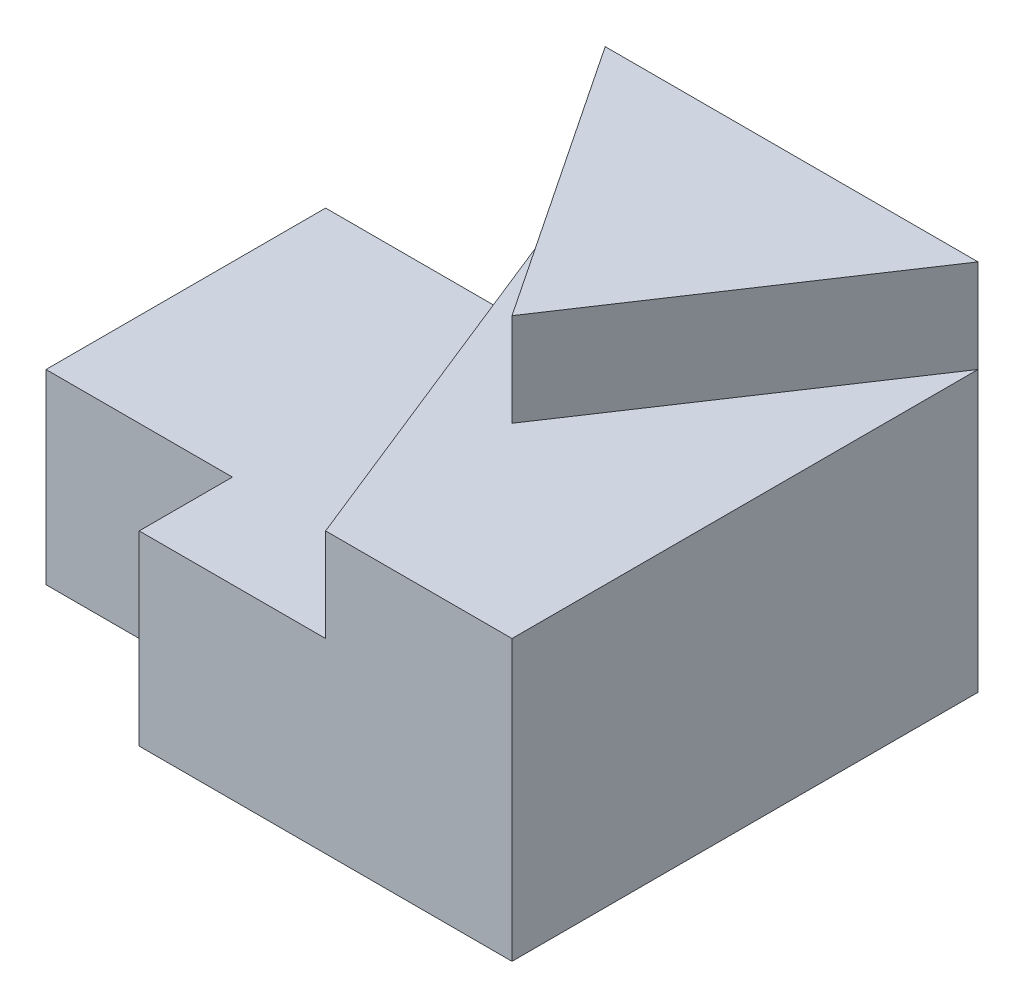
ISO-10303-21;
HEADER;
FILE_DESCRIPTION(('STEP AP214'),'2;1');
FILE_NAME('part.step','',(''),(''),'','','');
FILE_SCHEMA(('AUTOMOTIVE_DESIGN { 1 0 10303 214 1 1 1 1 }'));
ENDSEC;
DATA;
#1=APPLICATION_CONTEXT('core data for automotive mechanical design processes');
#2=APPLICATION_PROTOCOL_DEFINITION('international standard','automotive_design',2000,#1);
#3=PRODUCT_CONTEXT('',#1,'mechanical');
#4=PRODUCT('Part','Part','',(#3));
#5=PRODUCT_RELATED_PRODUCT_CATEGORY('part','',(#4));
#6=PRODUCT_DEFINITION_FORMATION('','',#4);
#7=PRODUCT_DEFINITION_CONTEXT('part definition',#1,'design');
#8=PRODUCT_DEFINITION('design','',#6,#7);
#9=PRODUCT_DEFINITION_SHAPE('','',#8);
#10=(LENGTH_UNIT() NAMED_UNIT(*) SI_UNIT(.MILLI.,.METRE.));
#11=(NAMED_UNIT(*) PLANE_ANGLE_UNIT() SI_UNIT($,.RADIAN.));
#12=(NAMED_UNIT(*) SI_UNIT($,.STERADIAN.) SOLID_ANGLE_UNIT());
#13=UNCERTAINTY_MEASURE_WITH_UNIT(LENGTH_MEASURE(1.E-05),#10,'distance_accuracy_value','');
#14=(GEOMETRIC_REPRESENTATION_CONTEXT(3) GLOBAL_UNCERTAINTY_ASSIGNED_CONTEXT((#13)) GLOBAL_UNIT_ASSIGNED_CONTEXT((#10,
#11,#12)) REPRESENTATION_CONTEXT('',''));
#15=CARTESIAN_POINT('',(0.,0.,0.));
#16=DIRECTION('',(0.,0.,1.));
#17=DIRECTION('',(1.,0.,0.));
#18=AXIS2_PLACEMENT_3D('',#15,#16,#17);
#19=CARTESIAN_POINT('',(0.,9.99999999999999,25.));
#20=DIRECTION('',(1.,0.,0.));
#21=DIRECTION('',(0.,1.,0.));
#22=AXIS2_PLACEMENT_3D('',#19,#20,#21);
#23=PLANE('',#22);
#24=DIRECTION('',(0.,0.,1.));
#25=VECTOR('',#24,1.);
#26=CARTESIAN_POINT('',(0.,9.99999999999998,0.));
#27=LINE('',#26,#25);
#28=CARTESIAN_POINT('',(0.,9.99999999999998,0.));
#29=VERTEX_POINT('',#28);
#30=CARTESIAN_POINT('',(0.,9.99999999999998,5.));
#31=VERTEX_POINT('',#30);
#32=EDGE_CURVE('E129',#29,#31,#27,.T.);
#33=ORIENTED_EDGE('',*,*,#32,.F.);
#34=DIRECTION('',(0.,-1.,0.));
#35=VECTOR('',#34,1.);
#36=CARTESIAN_POINT('',(0.,9.99999999999999,0.));
#37=LINE('',#36,#35);
#38=CARTESIAN_POINT('',(0.,0.,0.));
#39=VERTEX_POINT('',#38);
#40=EDGE_CURVE('E161',#29,#39,#37,.T.);
#41=ORIENTED_EDGE('',*,*,#40,.T.);
#42=DIRECTION('',(0.,0.,-1.));
#43=VECTOR('',#42,1.);
#44=CARTESIAN_POINT('',(0.,0.,25.));
#45=LINE('',#44,#43);
#46=CARTESIAN_POINT('',(0.,0.,5.));
#47=VERTEX_POINT('',#46);
#48=EDGE_CURVE('E40',#47,#39,#45,.T.);
#49=ORIENTED_EDGE('',*,*,#48,.F.);
#50=DIRECTION('',(0.,-1.,0.));
#51=VECTOR('',#50,1.);
#52=CARTESIAN_POINT('',(0.,0.,5.));
#53=LINE('',#52,#51);
#54=EDGE_CURVE('E207',#31,#47,#53,.T.);
#55=ORIENTED_EDGE('',*,*,#54,.F.);
#56=EDGE_LOOP('',(#33,#41,#49,#55));
#57=FACE_BOUND('',#56,.T.);
#58=ADVANCED_FACE('F33',(#57),#23,.F.);
#59=CARTESIAN_POINT('',(0.,9.99999999999998,20.));
#60=VERTEX_POINT('',#59);
#61=CARTESIAN_POINT('',(0.,9.99999999999998,25.));
#62=VERTEX_POINT('',#61);
#63=EDGE_CURVE('E118',#60,#62,#27,.T.);
#64=ORIENTED_EDGE('',*,*,#63,.F.);
#65=DIRECTION('',(0.,1.,0.));
#66=VECTOR('',#65,1.);
#67=CARTESIAN_POINT('',(0.,0.,20.));
#68=LINE('',#67,#66);
#69=CARTESIAN_POINT('',(0.,0.,20.));
#70=VERTEX_POINT('',#69);
#71=EDGE_CURVE('E197',#70,#60,#68,.T.);
#72=ORIENTED_EDGE('',*,*,#71,.F.);
#73=CARTESIAN_POINT('',(0.,0.,25.));
#74=VERTEX_POINT('',#73);
#75=EDGE_CURVE('E11',#74,#70,#45,.T.);
#76=ORIENTED_EDGE('',*,*,#75,.F.);
#77=DIRECTION('',(0.,-1.,0.));
#78=VECTOR('',#77,1.);
#79=CARTESIAN_POINT('',(0.,9.99999999999999,25.));
#80=LINE('',#79,#78);
#81=EDGE_CURVE('E134',#62,#74,#80,.T.);
#82=ORIENTED_EDGE('',*,*,#81,.F.);
#83=EDGE_LOOP('',(#64,#72,#76,#82));
#84=FACE_BOUND('',#83,.T.);
#85=ADVANCED_FACE('F140',(#84),#23,.F.);
#86=CARTESIAN_POINT('',(20.,0.,25.));
#87=DIRECTION('',(-1.,0.,0.));
#88=DIRECTION('',(0.,-1.,0.));
#89=AXIS2_PLACEMENT_3D('',#86,#87,#88);
#90=PLANE('',#89);
#91=DIRECTION('',(0.,0.,-1.));
#92=VECTOR('',#91,1.);
#93=CARTESIAN_POINT('',(20.,15.,25.));
#94=LINE('',#93,#92);
#95=CARTESIAN_POINT('',(20.,15.,25.));
#96=VERTEX_POINT('',#95);
#97=CARTESIAN_POINT('',(20.,15.,0.));
#98=VERTEX_POINT('',#97);
#99=EDGE_CURVE('E184',#96,#98,#94,.T.);
#100=ORIENTED_EDGE('',*,*,#99,.F.);
#101=DIRECTION('',(0.,1.,0.));
#102=VECTOR('',#101,1.);
#103=CARTESIAN_POINT('',(20.,0.,25.));
#104=LINE('',#103,#102);
#105=CARTESIAN_POINT('',(20.,0.,25.));
#106=VERTEX_POINT('',#105);
#107=EDGE_CURVE('E144',#106,#96,#104,.T.);
#108=ORIENTED_EDGE('',*,*,#107,.F.);
#109=DIRECTION('',(0.,0.,-1.));
#110=VECTOR('',#109,1.);
#111=CARTESIAN_POINT('',(20.,0.,25.));
#112=LINE('',#111,#110);
#113=CARTESIAN_POINT('',(20.,0.,0.));
#114=VERTEX_POINT('',#113);
#115=EDGE_CURVE('E155',#106,#114,#112,.T.);
#116=ORIENTED_EDGE('',*,*,#115,.T.);
#117=DIRECTION('',(0.,1.,0.));
#118=VECTOR('',#117,1.);
#119=CARTESIAN_POINT('',(20.,0.,0.));
#120=LINE('',#119,#118);
#121=EDGE_CURVE('E147',#114,#98,#120,.T.);
#122=ORIENTED_EDGE('',*,*,#121,.T.);
#123=EDGE_LOOP('',(#100,#108,#116,#122));
#124=FACE_BOUND('',#123,.T.);
#125=ADVANCED_FACE('F183',(#124),#90,.F.);
#126=CARTESIAN_POINT('',(0.,0.,25.));
#127=DIRECTION('',(0.,0.,1.));
#128=DIRECTION('',(1.,0.,0.));
#129=AXIS2_PLACEMENT_3D('',#126,#127,#128);
#130=PLANE('',#129);
#131=DIRECTION('',(0.,1.,0.));
#132=VECTOR('',#131,1.);
#133=CARTESIAN_POINT('',(10.,9.99999999999999,25.));
#134=LINE('',#133,#132);
#135=CARTESIAN_POINT('',(10.,9.99999999999999,25.));
#136=VERTEX_POINT('',#135);
#137=CARTESIAN_POINT('',(10.,15.,25.));
#138=VERTEX_POINT('',#137);
#139=EDGE_CURVE('E47',#136,#138,#134,.T.);
#140=ORIENTED_EDGE('',*,*,#139,.F.);
#141=DIRECTION('',(1.,0.,0.));
#142=VECTOR('',#141,1.);
#143=CARTESIAN_POINT('',(0.,9.99999999999998,25.));
#144=LINE('',#143,#142);
#145=EDGE_CURVE('E122',#62,#136,#144,.T.);
#146=ORIENTED_EDGE('',*,*,#145,.F.);
#147=ORIENTED_EDGE('',*,*,#81,.T.);
#148=DIRECTION('',(1.,0.,0.));
#149=VECTOR('',#148,1.);
#150=CARTESIAN_POINT('',(0.,0.,25.));
#151=LINE('',#150,#149);
#152=EDGE_CURVE('E141',#74,#106,#151,.T.);
#153=ORIENTED_EDGE('',*,*,#152,.T.);
#154=ORIENTED_EDGE('',*,*,#107,.T.);
#155=DIRECTION('',(1.,0.,0.));
#156=VECTOR('',#155,1.);
#157=CARTESIAN_POINT('',(0.,15.,25.));
#158=LINE('',#157,#156);
#159=EDGE_CURVE('E189',#138,#96,#158,.T.);
#160=ORIENTED_EDGE('',*,*,#159,.F.);
#161=EDGE_LOOP('',(#140,#146,#147,#153,#154,#160));
#162=FACE_BOUND('',#161,.T.);
#163=ADVANCED_FACE('F133',(#162),#130,.T.);
#164=CARTESIAN_POINT('',(10.,10.,25.));
#165=DIRECTION('',(0.,-1.,0.));
#166=DIRECTION('',(1.,0.,0.));
#167=AXIS2_PLACEMENT_3D('',#164,#165,#166);
#168=PLANE('',#167);
#169=DIRECTION('',(1.,0.,0.));
#170=VECTOR('',#169,1.);
#171=CARTESIAN_POINT('',(-10.,9.99999999999999,20.));
#172=LINE('',#171,#170);
#173=CARTESIAN_POINT('',(-10.,9.99999999999999,20.));
#174=VERTEX_POINT('',#173);
#175=EDGE_CURVE('E125',#174,#60,#172,.T.);
#176=ORIENTED_EDGE('',*,*,#175,.T.);
#177=ORIENTED_EDGE('',*,*,#63,.T.);
#178=ORIENTED_EDGE('',*,*,#145,.T.);
#179=DIRECTION('',(-0.371390676354104,0.,-0.928476690885259));
#180=VECTOR('',#179,1.);
#181=CARTESIAN_POINT('',(10.,9.99999999999999,25.));
#182=LINE('',#181,#180);
#183=EDGE_CURVE('E137',#136,#29,#182,.T.);
#184=ORIENTED_EDGE('',*,*,#183,.T.);
#185=ORIENTED_EDGE('',*,*,#32,.T.);
#186=DIRECTION('',(1.,0.,0.));
#187=VECTOR('',#186,1.);
#188=CARTESIAN_POINT('',(-10.,9.99999999999999,5.));
#189=LINE('',#188,#187);
#190=CARTESIAN_POINT('',(-10.,9.99999999999999,5.));
#191=VERTEX_POINT('',#190);
#192=EDGE_CURVE('E199',#191,#31,#189,.T.);
#193=ORIENTED_EDGE('',*,*,#192,.F.);
#194=DIRECTION('',(0.,0.,-1.));
#195=VECTOR('',#194,1.);
#196=CARTESIAN_POINT('',(-10.,9.99999999999999,5.));
#197=LINE('',#196,#195);
#198=EDGE_CURVE('E204',#174,#191,#197,.T.);
#199=ORIENTED_EDGE('',*,*,#198,.F.);
#200=EDGE_LOOP('',(#176,#177,#178,#184,#185,#193,#199));
#201=FACE_BOUND('',#200,.T.);
#202=ADVANCED_FACE('F120',(#201),#168,.F.);
#203=CARTESIAN_POINT('',(0.,0.,25.));
#204=DIRECTION('',(0.,1.,0.));
#205=DIRECTION('',(0.,0.,1.));
#206=AXIS2_PLACEMENT_3D('',#203,#204,#205);
#207=PLANE('',#206);
#208=DIRECTION('',(1.,0.,0.));
#209=VECTOR('',#208,1.);
#210=CARTESIAN_POINT('',(0.,0.,0.));
#211=LINE('',#210,#209);
#212=EDGE_CURVE('E159',#39,#114,#211,.T.);
#213=ORIENTED_EDGE('',*,*,#212,.T.);
#214=ORIENTED_EDGE('',*,*,#115,.F.);
#215=ORIENTED_EDGE('',*,*,#152,.F.);
#216=ORIENTED_EDGE('',*,*,#75,.T.);
#217=DIRECTION('',(1.,0.,0.));
#218=VECTOR('',#217,1.);
#219=CARTESIAN_POINT('',(-10.,0.,20.));
#220=LINE('',#219,#218);
#221=CARTESIAN_POINT('',(-10.,0.,20.));
#222=VERTEX_POINT('',#221);
#223=EDGE_CURVE('E193',#222,#70,#220,.T.);
#224=ORIENTED_EDGE('',*,*,#223,.F.);
#225=DIRECTION('',(0.,0.,1.));
#226=VECTOR('',#225,1.);
#227=CARTESIAN_POINT('',(-10.,0.,5.));
#228=LINE('',#227,#226);
#229=CARTESIAN_POINT('',(-10.,0.,5.));
#230=VERTEX_POINT('',#229);
#231=EDGE_CURVE('E212',#230,#222,#228,.T.);
#232=ORIENTED_EDGE('',*,*,#231,.F.);
#233=DIRECTION('',(1.,0.,0.));
#234=VECTOR('',#233,1.);
#235=CARTESIAN_POINT('',(-10.,0.,5.));
#236=LINE('',#235,#234);
#237=EDGE_CURVE('E150',#230,#47,#236,.T.);
#238=ORIENTED_EDGE('',*,*,#237,.T.);
#239=ORIENTED_EDGE('',*,*,#48,.T.);
#240=EDGE_LOOP('',(#213,#214,#215,#216,#224,#232,#238,#239));
#241=FACE_BOUND('',#240,.T.);
#242=ADVANCED_FACE('F171',(#241),#207,.F.);
#243=CARTESIAN_POINT('',(20.,20.,25.));
#244=DIRECTION('',(0.,-1.,0.));
#245=DIRECTION('',(1.,0.,0.));
#246=AXIS2_PLACEMENT_3D('',#243,#244,#245);
#247=PLANE('',#246);
#248=DIRECTION('',(-1.,0.,0.));
#249=VECTOR('',#248,1.);
#250=CARTESIAN_POINT('',(20.,20.,0.));
#251=LINE('',#250,#249);
#252=CARTESIAN_POINT('',(20.,20.,0.));
#253=VERTEX_POINT('',#252);
#254=CARTESIAN_POINT('',(0.,20.,0.));
#255=VERTEX_POINT('',#254);
#256=EDGE_CURVE('E142',#253,#255,#251,.T.);
#257=ORIENTED_EDGE('',*,*,#256,.T.);
#258=DIRECTION('',(-0.554700196225229,0.,-0.832050294337843));
#259=VECTOR('',#258,1.);
#260=CARTESIAN_POINT('',(10.,20.,15.));
#261=LINE('',#260,#259);
#262=CARTESIAN_POINT('',(10.,20.,15.));
#263=VERTEX_POINT('',#262);
#264=EDGE_CURVE('E222',#263,#255,#261,.T.);
#265=ORIENTED_EDGE('',*,*,#264,.F.);
#266=DIRECTION('',(-0.554700196225229,0.,0.832050294337844));
#267=VECTOR('',#266,1.);
#268=CARTESIAN_POINT('',(20.,20.,0.));
#269=LINE('',#268,#267);
#270=EDGE_CURVE('E218',#253,#263,#269,.T.);
#271=ORIENTED_EDGE('',*,*,#270,.F.);
#272=EDGE_LOOP('',(#257,#265,#271));
#273=FACE_BOUND('',#272,.T.);
#274=ADVANCED_FACE('F261',(#273),#247,.F.);
#275=CARTESIAN_POINT('',(0.,0.,0.));
#276=DIRECTION('',(0.,0.,1.));
#277=DIRECTION('',(1.,0.,0.));
#278=AXIS2_PLACEMENT_3D('',#275,#276,#277);
#279=PLANE('',#278);
#280=CARTESIAN_POINT('',(0.,15.,0.));
#281=VERTEX_POINT('',#280);
#282=EDGE_CURVE('E156',#255,#281,#37,.T.);
#283=ORIENTED_EDGE('',*,*,#282,.F.);
#284=ORIENTED_EDGE('',*,*,#256,.F.);
#285=DIRECTION('',(0.,1.,0.));
#286=VECTOR('',#285,1.);
#287=CARTESIAN_POINT('',(20.,15.,0.));
#288=LINE('',#287,#286);
#289=EDGE_CURVE('E181',#98,#253,#288,.T.);
#290=ORIENTED_EDGE('',*,*,#289,.F.);
#291=ORIENTED_EDGE('',*,*,#121,.F.);
#292=ORIENTED_EDGE('',*,*,#212,.F.);
#293=ORIENTED_EDGE('',*,*,#40,.F.);
#294=EDGE_CURVE('E160',#281,#29,#37,.T.);
#295=ORIENTED_EDGE('',*,*,#294,.F.);
#296=EDGE_LOOP('',(#283,#284,#290,#291,#292,#293,#295));
#297=FACE_BOUND('',#296,.T.);
#298=ADVANCED_FACE('F177',(#297),#279,.F.);
#299=CARTESIAN_POINT('',(-10.,0.,5.));
#300=DIRECTION('',(0.,0.,1.));
#301=DIRECTION('',(0.,-1.,0.));
#302=AXIS2_PLACEMENT_3D('',#299,#300,#301);
#303=PLANE('',#302);
#304=ORIENTED_EDGE('',*,*,#54,.T.);
#305=ORIENTED_EDGE('',*,*,#237,.F.);
#306=DIRECTION('',(0.,-1.,0.));
#307=VECTOR('',#306,1.);
#308=CARTESIAN_POINT('',(-10.,0.,5.));
#309=LINE('',#308,#307);
#310=EDGE_CURVE('E206',#191,#230,#309,.T.);
#311=ORIENTED_EDGE('',*,*,#310,.F.);
#312=ORIENTED_EDGE('',*,*,#192,.T.);
#313=EDGE_LOOP('',(#304,#305,#311,#312));
#314=FACE_BOUND('',#313,.T.);
#315=ADVANCED_FACE('F234',(#314),#303,.F.);
#316=CARTESIAN_POINT('',(-10.,0.,20.));
#317=DIRECTION('',(0.,0.,-1.));
#318=DIRECTION('',(-1.,0.,0.));
#319=AXIS2_PLACEMENT_3D('',#316,#317,#318);
#320=PLANE('',#319);
#321=ORIENTED_EDGE('',*,*,#71,.T.);
#322=ORIENTED_EDGE('',*,*,#175,.F.);
#323=DIRECTION('',(0.,1.,0.));
#324=VECTOR('',#323,1.);
#325=CARTESIAN_POINT('',(-10.,0.,20.));
#326=LINE('',#325,#324);
#327=EDGE_CURVE('E198',#222,#174,#326,.T.);
#328=ORIENTED_EDGE('',*,*,#327,.F.);
#329=ORIENTED_EDGE('',*,*,#223,.T.);
#330=EDGE_LOOP('',(#321,#322,#328,#329));
#331=FACE_BOUND('',#330,.T.);
#332=ADVANCED_FACE('F196',(#331),#320,.F.);
#333=CARTESIAN_POINT('',(-10.,0.,0.));
#334=DIRECTION('',(1.,0.,0.));
#335=DIRECTION('',(0.,1.,0.));
#336=AXIS2_PLACEMENT_3D('',#333,#334,#335);
#337=PLANE('',#336);
#338=ORIENTED_EDGE('',*,*,#310,.T.);
#339=ORIENTED_EDGE('',*,*,#231,.T.);
#340=ORIENTED_EDGE('',*,*,#327,.T.);
#341=ORIENTED_EDGE('',*,*,#198,.T.);
#342=EDGE_LOOP('',(#338,#339,#340,#341));
#343=FACE_BOUND('',#342,.T.);
#344=ADVANCED_FACE('F236',(#343),#337,.F.);
#345=CARTESIAN_POINT('',(10.,15.,15.));
#346=DIRECTION('',(0.832050294337843,0.,-0.554700196225229));
#347=DIRECTION('',(-0.554700196225229,0.,-0.832050294337844));
#348=AXIS2_PLACEMENT_3D('',#345,#346,#347);
#349=PLANE('',#348);
#350=ORIENTED_EDGE('',*,*,#264,.T.);
#351=ORIENTED_EDGE('',*,*,#282,.T.);
#352=DIRECTION('',(-0.554700196225229,0.,-0.832050294337843));
#353=VECTOR('',#352,1.);
#354=CARTESIAN_POINT('',(10.,15.,15.));
#355=LINE('',#354,#353);
#356=CARTESIAN_POINT('',(10.,15.,15.));
#357=VERTEX_POINT('',#356);
#358=EDGE_CURVE('E221',#357,#281,#355,.T.);
#359=ORIENTED_EDGE('',*,*,#358,.F.);
#360=DIRECTION('',(0.,1.,0.));
#361=VECTOR('',#360,1.);
#362=CARTESIAN_POINT('',(10.,15.,15.));
#363=LINE('',#362,#361);
#364=EDGE_CURVE('E209',#357,#263,#363,.T.);
#365=ORIENTED_EDGE('',*,*,#364,.T.);
#366=EDGE_LOOP('',(#350,#351,#359,#365));
#367=FACE_BOUND('',#366,.T.);
#368=ADVANCED_FACE('F238',(#367),#349,.F.);
#369=CARTESIAN_POINT('',(20.,15.,0.));
#370=DIRECTION('',(-0.832050294337844,0.,-0.554700196225229));
#371=DIRECTION('',(-0.554700196225229,0.,0.832050294337844));
#372=AXIS2_PLACEMENT_3D('',#369,#370,#371);
#373=PLANE('',#372);
#374=ORIENTED_EDGE('',*,*,#270,.T.);
#375=ORIENTED_EDGE('',*,*,#364,.F.);
#376=DIRECTION('',(-0.554700196225229,0.,0.832050294337844));
#377=VECTOR('',#376,1.);
#378=CARTESIAN_POINT('',(20.,15.,0.));
#379=LINE('',#378,#377);
#380=EDGE_CURVE('E188',#98,#357,#379,.T.);
#381=ORIENTED_EDGE('',*,*,#380,.F.);
#382=ORIENTED_EDGE('',*,*,#289,.T.);
#383=EDGE_LOOP('',(#374,#375,#381,#382));
#384=FACE_BOUND('',#383,.T.);
#385=ADVANCED_FACE('F244',(#384),#373,.F.);
#386=CARTESIAN_POINT('',(0.,15.,0.));
#387=DIRECTION('',(0.,1.,0.));
#388=DIRECTION('',(-1.,0.,0.));
#389=AXIS2_PLACEMENT_3D('',#386,#387,#388);
#390=PLANE('',#389);
#391=DIRECTION('',(-0.371390676354104,0.,-0.928476690885259));
#392=VECTOR('',#391,1.);
#393=CARTESIAN_POINT('',(10.,15.,25.));
#394=LINE('',#393,#392);
#395=EDGE_CURVE('E130',#138,#281,#394,.T.);
#396=ORIENTED_EDGE('',*,*,#395,.F.);
#397=ORIENTED_EDGE('',*,*,#159,.T.);
#398=ORIENTED_EDGE('',*,*,#99,.T.);
#399=ORIENTED_EDGE('',*,*,#380,.T.);
#400=ORIENTED_EDGE('',*,*,#358,.T.);
#401=EDGE_LOOP('',(#396,#397,#398,#399,#400));
#402=FACE_BOUND('',#401,.T.);
#403=ADVANCED_FACE('F298',(#402),#390,.T.);
#404=CARTESIAN_POINT('',(10.,9.99999999999999,25.));
#405=DIRECTION('',(0.928476690885259,0.,-0.371390676354104));
#406=DIRECTION('',(-0.371390676354104,0.,-0.928476690885259));
#407=AXIS2_PLACEMENT_3D('',#404,#405,#406);
#408=PLANE('',#407);
#409=ORIENTED_EDGE('',*,*,#395,.T.);
#410=ORIENTED_EDGE('',*,*,#294,.T.);
#411=ORIENTED_EDGE('',*,*,#183,.F.);
#412=ORIENTED_EDGE('',*,*,#139,.T.);
#413=EDGE_LOOP('',(#409,#410,#411,#412));
#414=FACE_BOUND('',#413,.T.);
#415=ADVANCED_FACE('F303',(#414),#408,.F.);
#416=CLOSED_SHELL('',(#58,#85,#125,#163,#202,#242,#274,#298,#315,#332,#344,#368,#385,#403,#415));
#417=MANIFOLD_SOLID_BREP('B2',#416);
#418=ADVANCED_BREP_SHAPE_REPRESENTATION('',(#18,#417),#14);
#419=SHAPE_DEFINITION_REPRESENTATION(#9,#418);
ENDSEC;
END-ISO-10303-21;
